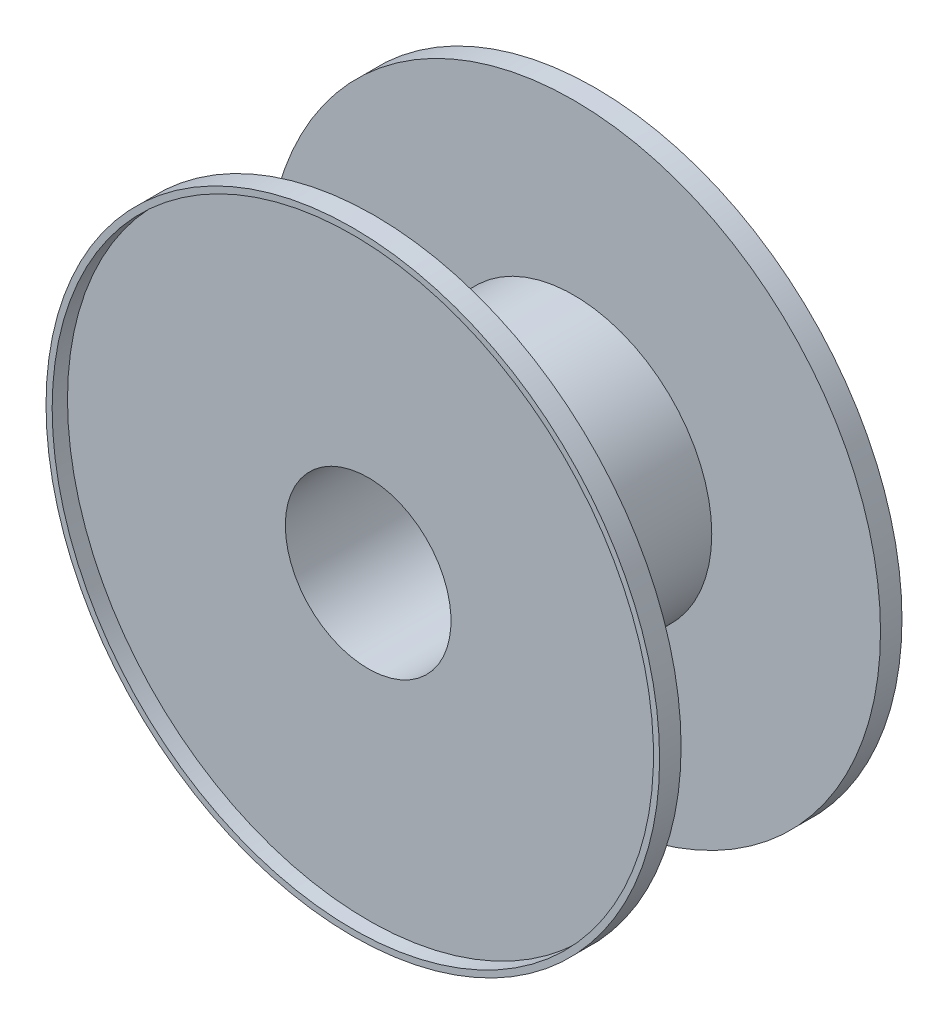
ISO-10303-21;
HEADER;
FILE_DESCRIPTION(('STEP AP214'),'2;1');
FILE_NAME('part.step','',(''),(''),'','','');
FILE_SCHEMA(('AUTOMOTIVE_DESIGN { 1 0 10303 214 1 1 1 1 }'));
ENDSEC;
DATA;
#1=APPLICATION_CONTEXT('core data for automotive mechanical design processes');
#2=APPLICATION_PROTOCOL_DEFINITION('international standard','automotive_design',2000,#1);
#3=PRODUCT_CONTEXT('',#1,'mechanical');
#4=PRODUCT('Part','Part','',(#3));
#5=PRODUCT_RELATED_PRODUCT_CATEGORY('part','',(#4));
#6=PRODUCT_DEFINITION_FORMATION('','',#4);
#7=PRODUCT_DEFINITION_CONTEXT('part definition',#1,'design');
#8=PRODUCT_DEFINITION('design','',#6,#7);
#9=PRODUCT_DEFINITION_SHAPE('','',#8);
#10=(LENGTH_UNIT() NAMED_UNIT(*) SI_UNIT(.MILLI.,.METRE.));
#11=(NAMED_UNIT(*) PLANE_ANGLE_UNIT() SI_UNIT($,.RADIAN.));
#12=(NAMED_UNIT(*) SI_UNIT($,.STERADIAN.) SOLID_ANGLE_UNIT());
#13=UNCERTAINTY_MEASURE_WITH_UNIT(LENGTH_MEASURE(1.E-05),#10,'distance_accuracy_value','');
#14=(GEOMETRIC_REPRESENTATION_CONTEXT(3) GLOBAL_UNCERTAINTY_ASSIGNED_CONTEXT((#13)) GLOBAL_UNIT_ASSIGNED_CONTEXT((#10,
#11,#12)) REPRESENTATION_CONTEXT('',''));
#15=CARTESIAN_POINT('',(0.,0.,0.));
#16=DIRECTION('',(0.,0.,1.));
#17=DIRECTION('',(1.,0.,0.));
#18=AXIS2_PLACEMENT_3D('',#15,#16,#17);
#19=CARTESIAN_POINT('',(0.,0.,65.));
#20=DIRECTION('',(0.,0.,1.));
#21=DIRECTION('',(1.,0.,0.));
#22=AXIS2_PLACEMENT_3D('',#19,#20,#21);
#23=PLANE('',#22);
#24=CARTESIAN_POINT('',(0.,0.,65.));
#25=DIRECTION('',(0.,0.,-1.));
#26=DIRECTION('',(-1.,0.,0.));
#27=AXIS2_PLACEMENT_3D('',#24,#25,#26);
#28=CIRCLE('',#27,100.);
#29=CARTESIAN_POINT('',(-100.,0.,65.));
#30=VERTEX_POINT('',#29);
#31=EDGE_CURVE('E18',#30,#30,#28,.F.);
#32=ORIENTED_EDGE('',*,*,#31,.F.);
#33=EDGE_LOOP('',(#32));
#34=FACE_BOUND('',#33,.T.);
#35=CARTESIAN_POINT('',(0.,0.,65.));
#36=DIRECTION('',(0.,0.,-1.));
#37=DIRECTION('',(-1.,0.,0.));
#38=AXIS2_PLACEMENT_3D('',#35,#36,#37);
#39=CIRCLE('',#38,45.);
#40=CARTESIAN_POINT('',(-45.,0.,65.));
#41=VERTEX_POINT('',#40);
#42=EDGE_CURVE('E52',#41,#41,#39,.T.);
#43=ORIENTED_EDGE('',*,*,#42,.F.);
#44=EDGE_LOOP('',(#43));
#45=FACE_BOUND('',#44,.T.);
#46=ADVANCED_FACE('F15',(#34,#45),#23,.F.);
#47=CARTESIAN_POINT('',(0.,0.,67.));
#48=DIRECTION('',(0.,0.,-1.));
#49=DIRECTION('',(-1.,0.,0.));
#50=AXIS2_PLACEMENT_3D('',#47,#48,#49);
#51=CYLINDRICAL_SURFACE('',#50,100.);
#52=ORIENTED_EDGE('',*,*,#31,.T.);
#53=EDGE_LOOP('',(#52));
#54=FACE_BOUND('',#53,.T.);
#55=CARTESIAN_POINT('',(0.,0.,72.));
#56=DIRECTION('',(0.,0.,-1.));
#57=DIRECTION('',(-1.,0.,0.));
#58=AXIS2_PLACEMENT_3D('',#55,#56,#57);
#59=CIRCLE('',#58,100.);
#60=CARTESIAN_POINT('',(-100.,0.,72.));
#61=VERTEX_POINT('',#60);
#62=EDGE_CURVE('E50',#61,#61,#59,.F.);
#63=ORIENTED_EDGE('',*,*,#62,.F.);
#64=EDGE_LOOP('',(#63));
#65=FACE_BOUND('',#64,.T.);
#66=ADVANCED_FACE('F59',(#54,#65),#51,.T.);
#67=CARTESIAN_POINT('',(0.,0.,65.));
#68=DIRECTION('',(0.,0.,-1.));
#69=DIRECTION('',(-1.,0.,0.));
#70=AXIS2_PLACEMENT_3D('',#67,#68,#69);
#71=CYLINDRICAL_SURFACE('',#70,45.);
#72=ORIENTED_EDGE('',*,*,#42,.T.);
#73=EDGE_LOOP('',(#72));
#74=FACE_BOUND('',#73,.T.);
#75=CARTESIAN_POINT('',(0.,0.,0.));
#76=DIRECTION('',(0.,0.,-1.));
#77=DIRECTION('',(-1.,0.,0.));
#78=AXIS2_PLACEMENT_3D('',#75,#76,#77);
#79=CIRCLE('',#78,45.);
#80=CARTESIAN_POINT('',(-45.,0.,0.));
#81=VERTEX_POINT('',#80);
#82=EDGE_CURVE('E47',#81,#81,#79,.F.);
#83=ORIENTED_EDGE('',*,*,#82,.T.);
#84=EDGE_LOOP('',(#83));
#85=FACE_BOUND('',#84,.T.);
#86=ADVANCED_FACE('F67',(#74,#85),#71,.T.);
#87=CARTESIAN_POINT('',(0.,0.,72.));
#88=DIRECTION('',(0.,0.,1.));
#89=DIRECTION('',(1.,0.,0.));
#90=AXIS2_PLACEMENT_3D('',#87,#88,#89);
#91=PLANE('',#90);
#92=CARTESIAN_POINT('',(0.,0.,72.));
#93=DIRECTION('',(0.,0.,-1.));
#94=DIRECTION('',(-1.,0.,0.));
#95=AXIS2_PLACEMENT_3D('',#92,#93,#94);
#96=CIRCLE('',#95,98.);
#97=CARTESIAN_POINT('',(-98.,0.,72.));
#98=VERTEX_POINT('',#97);
#99=EDGE_CURVE('E44',#98,#98,#96,.T.);
#100=ORIENTED_EDGE('',*,*,#99,.T.);
#101=EDGE_LOOP('',(#100));
#102=FACE_BOUND('',#101,.T.);
#103=ORIENTED_EDGE('',*,*,#62,.T.);
#104=EDGE_LOOP('',(#103));
#105=FACE_BOUND('',#104,.T.);
#106=ADVANCED_FACE('F102',(#102,#105),#91,.T.);
#107=CARTESIAN_POINT('',(0.,0.,0.));
#108=DIRECTION('',(0.,0.,-1.));
#109=DIRECTION('',(-1.,0.,0.));
#110=AXIS2_PLACEMENT_3D('',#107,#108,#109);
#111=PLANE('',#110);
#112=CARTESIAN_POINT('',(0.,0.,0.));
#113=DIRECTION('',(0.,0.,1.));
#114=DIRECTION('',(1.,0.,0.));
#115=AXIS2_PLACEMENT_3D('',#112,#113,#114);
#116=CIRCLE('',#115,100.);
#117=CARTESIAN_POINT('',(100.,0.,0.));
#118=VERTEX_POINT('',#117);
#119=EDGE_CURVE('E41',#118,#118,#116,.F.);
#120=ORIENTED_EDGE('',*,*,#119,.F.);
#121=EDGE_LOOP('',(#120));
#122=FACE_BOUND('',#121,.T.);
#123=ORIENTED_EDGE('',*,*,#82,.F.);
#124=EDGE_LOOP('',(#123));
#125=FACE_BOUND('',#124,.T.);
#126=ADVANCED_FACE('F98',(#122,#125),#111,.F.);
#127=CARTESIAN_POINT('',(0.,0.,72.));
#128=DIRECTION('',(0.,0.,-1.));
#129=DIRECTION('',(-1.,0.,0.));
#130=AXIS2_PLACEMENT_3D('',#127,#128,#129);
#131=CYLINDRICAL_SURFACE('',#130,98.);
#132=CARTESIAN_POINT('',(0.,0.,67.));
#133=DIRECTION('',(0.,0.,-1.));
#134=DIRECTION('',(-1.,0.,0.));
#135=AXIS2_PLACEMENT_3D('',#132,#133,#134);
#136=CIRCLE('',#135,98.);
#137=CARTESIAN_POINT('',(-98.,0.,67.));
#138=VERTEX_POINT('',#137);
#139=EDGE_CURVE('E38',#138,#138,#136,.F.);
#140=ORIENTED_EDGE('',*,*,#139,.F.);
#141=EDGE_LOOP('',(#140));
#142=FACE_BOUND('',#141,.T.);
#143=ORIENTED_EDGE('',*,*,#99,.F.);
#144=EDGE_LOOP('',(#143));
#145=FACE_BOUND('',#144,.T.);
#146=ADVANCED_FACE('F94',(#142,#145),#131,.F.);
#147=CARTESIAN_POINT('',(0.,0.,-2.));
#148=DIRECTION('',(0.,0.,1.));
#149=DIRECTION('',(1.,0.,0.));
#150=AXIS2_PLACEMENT_3D('',#147,#148,#149);
#151=CYLINDRICAL_SURFACE('',#150,100.);
#152=ORIENTED_EDGE('',*,*,#119,.T.);
#153=EDGE_LOOP('',(#152));
#154=FACE_BOUND('',#153,.T.);
#155=CARTESIAN_POINT('',(0.,0.,-7.));
#156=DIRECTION('',(0.,0.,1.));
#157=DIRECTION('',(1.,0.,0.));
#158=AXIS2_PLACEMENT_3D('',#155,#156,#157);
#159=CIRCLE('',#158,100.);
#160=CARTESIAN_POINT('',(100.,0.,-7.));
#161=VERTEX_POINT('',#160);
#162=EDGE_CURVE('E35',#161,#161,#159,.F.);
#163=ORIENTED_EDGE('',*,*,#162,.F.);
#164=EDGE_LOOP('',(#163));
#165=FACE_BOUND('',#164,.T.);
#166=ADVANCED_FACE('F90',(#154,#165),#151,.T.);
#167=CARTESIAN_POINT('',(0.,0.,67.));
#168=DIRECTION('',(0.,0.,1.));
#169=DIRECTION('',(1.,0.,0.));
#170=AXIS2_PLACEMENT_3D('',#167,#168,#169);
#171=PLANE('',#170);
#172=ORIENTED_EDGE('',*,*,#139,.T.);
#173=EDGE_LOOP('',(#172));
#174=FACE_BOUND('',#173,.T.);
#175=CARTESIAN_POINT('',(0.,0.,67.));
#176=DIRECTION('',(0.,0.,-1.));
#177=DIRECTION('',(-1.,0.,0.));
#178=AXIS2_PLACEMENT_3D('',#175,#176,#177);
#179=CIRCLE('',#178,27.);
#180=CARTESIAN_POINT('',(-27.,0.,67.));
#181=VERTEX_POINT('',#180);
#182=EDGE_CURVE('E32',#181,#181,#179,.T.);
#183=ORIENTED_EDGE('',*,*,#182,.T.);
#184=EDGE_LOOP('',(#183));
#185=FACE_BOUND('',#184,.T.);
#186=ADVANCED_FACE('F86',(#174,#185),#171,.T.);
#187=CARTESIAN_POINT('',(0.,0.,-7.));
#188=DIRECTION('',(0.,0.,-1.));
#189=DIRECTION('',(-1.,0.,0.));
#190=AXIS2_PLACEMENT_3D('',#187,#188,#189);
#191=PLANE('',#190);
#192=CARTESIAN_POINT('',(0.,0.,-7.));
#193=DIRECTION('',(0.,0.,1.));
#194=DIRECTION('',(1.,0.,0.));
#195=AXIS2_PLACEMENT_3D('',#192,#193,#194);
#196=CIRCLE('',#195,98.);
#197=CARTESIAN_POINT('',(98.,0.,-7.));
#198=VERTEX_POINT('',#197);
#199=EDGE_CURVE('E27',#198,#198,#196,.T.);
#200=ORIENTED_EDGE('',*,*,#199,.T.);
#201=EDGE_LOOP('',(#200));
#202=FACE_BOUND('',#201,.T.);
#203=ORIENTED_EDGE('',*,*,#162,.T.);
#204=EDGE_LOOP('',(#203));
#205=FACE_BOUND('',#204,.T.);
#206=ADVANCED_FACE('F82',(#202,#205),#191,.T.);
#207=CARTESIAN_POINT('',(0.,0.,65.));
#208=DIRECTION('',(0.,0.,-1.));
#209=DIRECTION('',(-1.,0.,0.));
#210=AXIS2_PLACEMENT_3D('',#207,#208,#209);
#211=CYLINDRICAL_SURFACE('',#210,27.);
#212=CARTESIAN_POINT('',(0.,0.,-2.));
#213=DIRECTION('',(0.,0.,-1.));
#214=DIRECTION('',(-1.,0.,0.));
#215=AXIS2_PLACEMENT_3D('',#212,#213,#214);
#216=CIRCLE('',#215,27.);
#217=CARTESIAN_POINT('',(-27.,0.,-2.));
#218=VERTEX_POINT('',#217);
#219=EDGE_CURVE('E22',#218,#218,#216,.F.);
#220=ORIENTED_EDGE('',*,*,#219,.F.);
#221=EDGE_LOOP('',(#220));
#222=FACE_BOUND('',#221,.T.);
#223=ORIENTED_EDGE('',*,*,#182,.F.);
#224=EDGE_LOOP('',(#223));
#225=FACE_BOUND('',#224,.T.);
#226=ADVANCED_FACE('F75',(#222,#225),#211,.F.);
#227=CARTESIAN_POINT('',(0.,0.,-7.));
#228=DIRECTION('',(0.,0.,1.));
#229=DIRECTION('',(1.,0.,0.));
#230=AXIS2_PLACEMENT_3D('',#227,#228,#229);
#231=CYLINDRICAL_SURFACE('',#230,98.);
#232=CARTESIAN_POINT('',(0.,0.,-2.));
#233=DIRECTION('',(0.,0.,1.));
#234=DIRECTION('',(1.,0.,0.));
#235=AXIS2_PLACEMENT_3D('',#232,#233,#234);
#236=CIRCLE('',#235,98.);
#237=CARTESIAN_POINT('',(98.,0.,-2.));
#238=VERTEX_POINT('',#237);
#239=EDGE_CURVE('E9',#238,#238,#236,.F.);
#240=ORIENTED_EDGE('',*,*,#239,.F.);
#241=EDGE_LOOP('',(#240));
#242=FACE_BOUND('',#241,.T.);
#243=ORIENTED_EDGE('',*,*,#199,.F.);
#244=EDGE_LOOP('',(#243));
#245=FACE_BOUND('',#244,.T.);
#246=ADVANCED_FACE('F70',(#242,#245),#231,.F.);
#247=CARTESIAN_POINT('',(0.,0.,-2.));
#248=DIRECTION('',(0.,0.,-1.));
#249=DIRECTION('',(-1.,0.,0.));
#250=AXIS2_PLACEMENT_3D('',#247,#248,#249);
#251=PLANE('',#250);
#252=ORIENTED_EDGE('',*,*,#239,.T.);
#253=EDGE_LOOP('',(#252));
#254=FACE_BOUND('',#253,.T.);
#255=ORIENTED_EDGE('',*,*,#219,.T.);
#256=EDGE_LOOP('',(#255));
#257=FACE_BOUND('',#256,.T.);
#258=ADVANCED_FACE('F68',(#254,#257),#251,.T.);
#259=CLOSED_SHELL('',(#46,#66,#86,#106,#126,#146,#166,#186,#206,#226,#246,#258));
#260=MANIFOLD_SOLID_BREP('B1',#259);
#261=ADVANCED_BREP_SHAPE_REPRESENTATION('',(#18,#260),#14);
#262=SHAPE_DEFINITION_REPRESENTATION(#9,#261);
ENDSEC;
END-ISO-10303-21;
